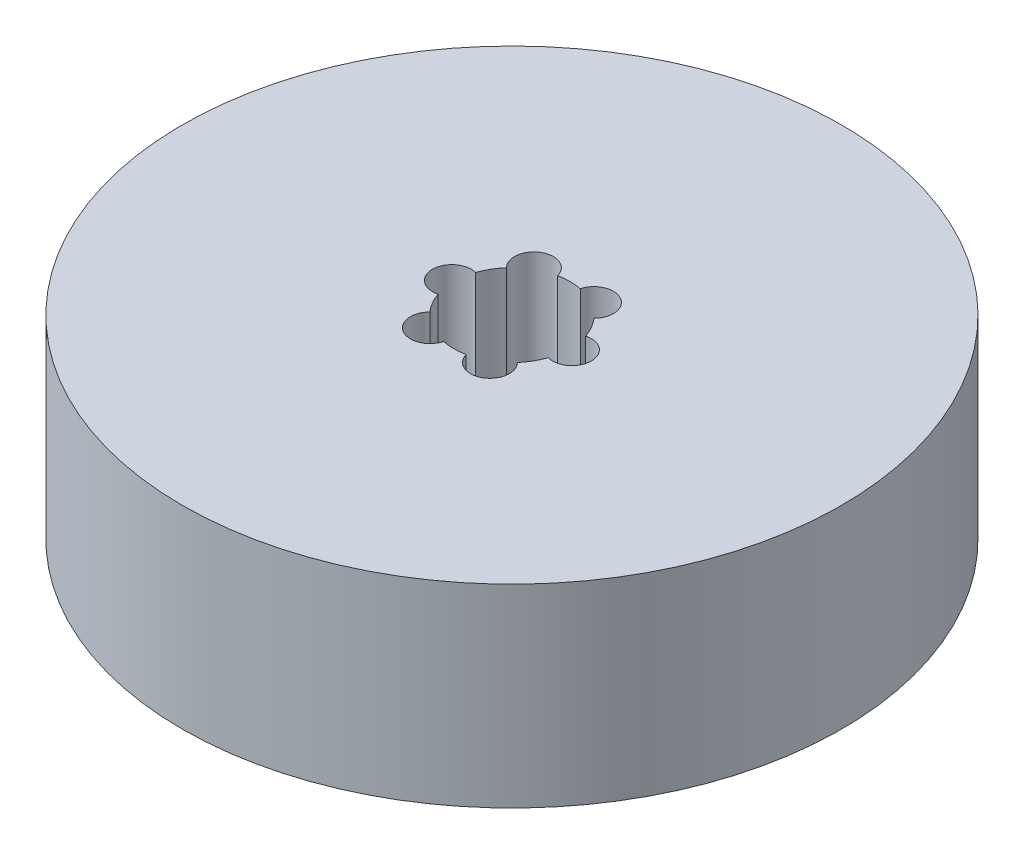
ISO-10303-21;
HEADER;
FILE_DESCRIPTION(('STEP AP214'),'2;1');
FILE_NAME('part.step','',(''),(''),'','','');
FILE_SCHEMA(('AUTOMOTIVE_DESIGN { 1 0 10303 214 1 1 1 1 }'));
ENDSEC;
DATA;
#1=APPLICATION_CONTEXT('core data for automotive mechanical design processes');
#2=APPLICATION_PROTOCOL_DEFINITION('international standard','automotive_design',2000,#1);
#3=PRODUCT_CONTEXT('',#1,'mechanical');
#4=PRODUCT('Part','Part','',(#3));
#5=PRODUCT_RELATED_PRODUCT_CATEGORY('part','',(#4));
#6=PRODUCT_DEFINITION_FORMATION('','',#4);
#7=PRODUCT_DEFINITION_CONTEXT('part definition',#1,'design');
#8=PRODUCT_DEFINITION('design','',#6,#7);
#9=PRODUCT_DEFINITION_SHAPE('','',#8);
#10=(LENGTH_UNIT() NAMED_UNIT(*) SI_UNIT(.MILLI.,.METRE.));
#11=(NAMED_UNIT(*) PLANE_ANGLE_UNIT() SI_UNIT($,.RADIAN.));
#12=(NAMED_UNIT(*) SI_UNIT($,.STERADIAN.) SOLID_ANGLE_UNIT());
#13=UNCERTAINTY_MEASURE_WITH_UNIT(LENGTH_MEASURE(1.E-05),#10,'distance_accuracy_value','');
#14=(GEOMETRIC_REPRESENTATION_CONTEXT(3) GLOBAL_UNCERTAINTY_ASSIGNED_CONTEXT((#13)) GLOBAL_UNIT_ASSIGNED_CONTEXT((#10,
#11,#12)) REPRESENTATION_CONTEXT('',''));
#15=CARTESIAN_POINT('',(0.,0.,0.));
#16=DIRECTION('',(0.,0.,1.));
#17=DIRECTION('',(1.,0.,0.));
#18=AXIS2_PLACEMENT_3D('',#15,#16,#17);
#19=CARTESIAN_POINT('',(0.,25.,0.));
#20=DIRECTION('',(0.,-1.,0.));
#21=DIRECTION('',(0.,0.,-1.));
#22=AXIS2_PLACEMENT_3D('',#19,#20,#21);
#23=CYLINDRICAL_SURFACE('',#22,42.5);
#24=CARTESIAN_POINT('',(0.,25.,0.));
#25=DIRECTION('',(0.,1.,0.));
#26=DIRECTION('',(0.,0.,1.));
#27=AXIS2_PLACEMENT_3D('',#24,#25,#26);
#28=CIRCLE('',#27,42.5);
#29=CARTESIAN_POINT('',(0.,25.,42.5));
#30=VERTEX_POINT('',#29);
#31=EDGE_CURVE('E171',#30,#30,#28,.T.);
#32=ORIENTED_EDGE('',*,*,#31,.F.);
#33=EDGE_LOOP('',(#32));
#34=FACE_BOUND('',#33,.T.);
#35=CARTESIAN_POINT('',(0.,0.,0.));
#36=DIRECTION('',(0.,1.,0.));
#37=DIRECTION('',(0.,0.,1.));
#38=AXIS2_PLACEMENT_3D('',#35,#36,#37);
#39=CIRCLE('',#38,42.5);
#40=CARTESIAN_POINT('',(0.,0.,42.5));
#41=VERTEX_POINT('',#40);
#42=EDGE_CURVE('E157',#41,#41,#39,.T.);
#43=ORIENTED_EDGE('',*,*,#42,.T.);
#44=EDGE_LOOP('',(#43));
#45=FACE_BOUND('',#44,.T.);
#46=ADVANCED_FACE('F39',(#34,#45),#23,.T.);
#47=CARTESIAN_POINT('',(0.,25.,0.));
#48=DIRECTION('',(0.,1.,0.));
#49=DIRECTION('',(0.,0.,1.));
#50=AXIS2_PLACEMENT_3D('',#47,#48,#49);
#51=PLANE('',#50);
#52=CARTESIAN_POINT('',(-3.87316655264964,25.,-6.70852125536539));
#53=DIRECTION('',(0.,1.,0.));
#54=DIRECTION('',(-0.866025403784433,0.,0.50000000000001));
#55=AXIS2_PLACEMENT_3D('',#52,#53,#54);
#56=CIRCLE('',#55,2.50070578781574);
#57=CARTESIAN_POINT('',(-1.45798384404562,25.,-7.35692076282611));
#58=VERTEX_POINT('',#57);
#59=CARTESIAN_POINT('',(-5.64228835221391,25.,-4.94111142866372));
#60=VERTEX_POINT('',#59);
#61=EDGE_CURVE('E214',#58,#60,#56,.T.);
#62=ORIENTED_EDGE('',*,*,#61,.F.);
#63=CARTESIAN_POINT('',(0.,25.,0.));
#64=DIRECTION('',(0.,1.,0.));
#65=DIRECTION('',(0.,0.,1.));
#66=AXIS2_PLACEMENT_3D('',#63,#64,#65);
#67=CIRCLE('',#66,7.5);
#68=CARTESIAN_POINT('',(1.45798384404547,25.,-7.35692076282614));
#69=VERTEX_POINT('',#68);
#70=EDGE_CURVE('E272',#69,#58,#67,.T.);
#71=ORIENTED_EDGE('',*,*,#70,.F.);
#72=CARTESIAN_POINT('',(3.8731665526495,25.,-6.70852125536547));
#73=DIRECTION('',(0.,1.,0.));
#74=DIRECTION('',(-0.866025403784443,0.,-0.499999999999992));
#75=AXIS2_PLACEMENT_3D('',#72,#73,#74);
#76=CIRCLE('',#75,2.50070578781574);
#77=CARTESIAN_POINT('',(5.64228835221381,25.,-4.94111142866384));
#78=VERTEX_POINT('',#77);
#79=EDGE_CURVE('E285',#78,#69,#76,.T.);
#80=ORIENTED_EDGE('',*,*,#79,.F.);
#81=CARTESIAN_POINT('',(7.10027219625939,25.,-2.41580933416234));
#82=VERTEX_POINT('',#81);
#83=EDGE_CURVE('E165',#82,#78,#67,.T.);
#84=ORIENTED_EDGE('',*,*,#83,.F.);
#85=CARTESIAN_POINT('',(7.74633310529912,25.,0.));
#86=DIRECTION('',(0.,1.,0.));
#87=DIRECTION('',(0.,0.,-1.));
#88=AXIS2_PLACEMENT_3D('',#85,#86,#87);
#89=CIRCLE('',#88,2.50070578781574);
#90=CARTESIAN_POINT('',(7.10027219625939,25.,2.41580933416234));
#91=VERTEX_POINT('',#90);
#92=EDGE_CURVE('E281',#91,#82,#89,.T.);
#93=ORIENTED_EDGE('',*,*,#92,.F.);
#94=CARTESIAN_POINT('',(5.64228835221387,25.,4.94111142866376));
#95=VERTEX_POINT('',#94);
#96=EDGE_CURVE('E160',#95,#91,#67,.T.);
#97=ORIENTED_EDGE('',*,*,#96,.F.);
#98=CARTESIAN_POINT('',(3.87316655264959,25.,6.70852125536542));
#99=DIRECTION('',(0.,1.,0.));
#100=DIRECTION('',(0.866025403784436,0.,-0.500000000000004));
#101=AXIS2_PLACEMENT_3D('',#98,#99,#100);
#102=CIRCLE('',#101,2.50070578781574);
#103=CARTESIAN_POINT('',(1.45798384404557,25.,7.35692076282612));
#104=VERTEX_POINT('',#103);
#105=EDGE_CURVE('E154',#104,#95,#102,.T.);
#106=ORIENTED_EDGE('',*,*,#105,.F.);
#107=CARTESIAN_POINT('',(-1.45798384404552,25.,7.35692076282613));
#108=VERTEX_POINT('',#107);
#109=EDGE_CURVE('E150',#108,#104,#67,.T.);
#110=ORIENTED_EDGE('',*,*,#109,.F.);
#111=CARTESIAN_POINT('',(-3.87316655264955,25.,6.70852125536545));
#112=DIRECTION('',(0.,1.,0.));
#113=DIRECTION('',(0.86602540378444,0.,0.499999999999998));
#114=AXIS2_PLACEMENT_3D('',#111,#112,#113);
#115=CIRCLE('',#114,2.50070578781574);
#116=CARTESIAN_POINT('',(-5.64228835221384,25.,4.9411114286638));
#117=VERTEX_POINT('',#116);
#118=EDGE_CURVE('E127',#117,#108,#115,.T.);
#119=ORIENTED_EDGE('',*,*,#118,.F.);
#120=CARTESIAN_POINT('',(-7.10027219625939,25.,2.41580933416234));
#121=VERTEX_POINT('',#120);
#122=EDGE_CURVE('E156',#121,#117,#67,.T.);
#123=ORIENTED_EDGE('',*,*,#122,.F.);
#124=CARTESIAN_POINT('',(-7.74633310529912,25.,0.));
#125=DIRECTION('',(0.,1.,0.));
#126=DIRECTION('',(0.,0.,1.));
#127=AXIS2_PLACEMENT_3D('',#124,#125,#126);
#128=CIRCLE('',#127,2.50070578781574);
#129=CARTESIAN_POINT('',(-7.10027219625939,25.,-2.41580933416234));
#130=VERTEX_POINT('',#129);
#131=EDGE_CURVE('E164',#130,#121,#128,.T.);
#132=ORIENTED_EDGE('',*,*,#131,.F.);
#133=EDGE_CURVE('E159',#60,#130,#67,.T.);
#134=ORIENTED_EDGE('',*,*,#133,.F.);
#135=EDGE_LOOP('',(#62,#71,#80,#84,#93,#97,#106,#110,#119,#123,#132,#134));
#136=FACE_BOUND('',#135,.T.);
#137=ORIENTED_EDGE('',*,*,#31,.T.);
#138=EDGE_LOOP('',(#137));
#139=FACE_BOUND('',#138,.T.);
#140=ADVANCED_FACE('F155',(#136,#139),#51,.T.);
#141=CARTESIAN_POINT('',(0.,0.,0.));
#142=DIRECTION('',(0.,1.,0.));
#143=DIRECTION('',(0.,0.,1.));
#144=AXIS2_PLACEMENT_3D('',#141,#142,#143);
#145=PLANE('',#144);
#146=CARTESIAN_POINT('',(0.,0.,0.));
#147=DIRECTION('',(0.,1.,0.));
#148=DIRECTION('',(0.,0.,1.));
#149=AXIS2_PLACEMENT_3D('',#146,#147,#148);
#150=CIRCLE('',#149,7.5);
#151=CARTESIAN_POINT('',(0.,0.,7.5));
#152=VERTEX_POINT('',#151);
#153=EDGE_CURVE('E170',#152,#152,#150,.T.);
#154=ORIENTED_EDGE('',*,*,#153,.T.);
#155=EDGE_LOOP('',(#154));
#156=FACE_BOUND('',#155,.T.);
#157=ORIENTED_EDGE('',*,*,#42,.F.);
#158=EDGE_LOOP('',(#157));
#159=FACE_BOUND('',#158,.T.);
#160=ADVANCED_FACE('F232',(#156,#159),#145,.F.);
#161=CARTESIAN_POINT('',(0.,25.,0.));
#162=DIRECTION('',(0.,-1.,0.));
#163=DIRECTION('',(0.,0.,-1.));
#164=AXIS2_PLACEMENT_3D('',#161,#162,#163);
#165=CYLINDRICAL_SURFACE('',#164,7.5);
#166=DIRECTION('',(0.,1.,0.));
#167=VECTOR('',#166,1.);
#168=CARTESIAN_POINT('',(-1.45798384404562,16.9126249795418,-7.35692076282611));
#169=LINE('',#168,#167);
#170=CARTESIAN_POINT('',(-1.45798384404562,8.82524995908369,-7.35692076282611));
#171=VERTEX_POINT('',#170);
#172=EDGE_CURVE('E11',#171,#58,#169,.T.);
#173=ORIENTED_EDGE('',*,*,#172,.F.);
#174=CARTESIAN_POINT('',(0.,8.82524995908369,0.));
#175=DIRECTION('',(0.,1.,0.));
#176=DIRECTION('',(0.,0.,1.));
#177=AXIS2_PLACEMENT_3D('',#174,#175,#176);
#178=CIRCLE('',#177,7.5);
#179=CARTESIAN_POINT('',(-5.64228835221391,8.82524995908369,-4.94111142866372));
#180=VERTEX_POINT('',#179);
#181=EDGE_CURVE('E209',#171,#180,#178,.T.);
#182=ORIENTED_EDGE('',*,*,#181,.T.);
#183=DIRECTION('',(0.,1.,0.));
#184=VECTOR('',#183,1.);
#185=CARTESIAN_POINT('',(-5.64228835221391,16.9126249795418,-4.94111142866372));
#186=LINE('',#185,#184);
#187=EDGE_CURVE('E46',#60,#180,#186,.F.);
#188=ORIENTED_EDGE('',*,*,#187,.F.);
#189=ORIENTED_EDGE('',*,*,#133,.T.);
#190=DIRECTION('',(0.,1.,0.));
#191=VECTOR('',#190,1.);
#192=CARTESIAN_POINT('',(-7.10027219625939,16.9126249795418,-2.41580933416234));
#193=LINE('',#192,#191);
#194=CARTESIAN_POINT('',(-7.10027219625939,8.82524995908369,-2.41580933416234));
#195=VERTEX_POINT('',#194);
#196=EDGE_CURVE('E185',#195,#130,#193,.T.);
#197=ORIENTED_EDGE('',*,*,#196,.F.);
#198=CARTESIAN_POINT('',(0.,8.82524995908369,0.));
#199=DIRECTION('',(0.,1.,0.));
#200=DIRECTION('',(0.,0.,1.));
#201=AXIS2_PLACEMENT_3D('',#198,#199,#200);
#202=CIRCLE('',#201,7.5);
#203=CARTESIAN_POINT('',(-7.10027219625939,8.82524995908369,2.41580933416234));
#204=VERTEX_POINT('',#203);
#205=EDGE_CURVE('E173',#195,#204,#202,.T.);
#206=ORIENTED_EDGE('',*,*,#205,.T.);
#207=DIRECTION('',(0.,1.,0.));
#208=VECTOR('',#207,1.);
#209=CARTESIAN_POINT('',(-7.10027219625939,16.9126249795418,2.41580933416234));
#210=LINE('',#209,#208);
#211=EDGE_CURVE('E178',#121,#204,#210,.F.);
#212=ORIENTED_EDGE('',*,*,#211,.F.);
#213=ORIENTED_EDGE('',*,*,#122,.T.);
#214=DIRECTION('',(0.,1.,0.));
#215=VECTOR('',#214,1.);
#216=CARTESIAN_POINT('',(-5.64228835221384,16.9126249795418,4.9411114286638));
#217=LINE('',#216,#215);
#218=CARTESIAN_POINT('',(-5.64228835221384,8.82524995908369,4.9411114286638));
#219=VERTEX_POINT('',#218);
#220=EDGE_CURVE('E132',#219,#117,#217,.T.);
#221=ORIENTED_EDGE('',*,*,#220,.F.);
#222=CARTESIAN_POINT('',(0.,8.82524995908369,0.));
#223=DIRECTION('',(0.,1.,0.));
#224=DIRECTION('',(0.,0.,1.));
#225=AXIS2_PLACEMENT_3D('',#222,#223,#224);
#226=CIRCLE('',#225,7.5);
#227=CARTESIAN_POINT('',(-1.45798384404552,8.82524995908369,7.35692076282613));
#228=VERTEX_POINT('',#227);
#229=EDGE_CURVE('E146',#219,#228,#226,.T.);
#230=ORIENTED_EDGE('',*,*,#229,.T.);
#231=DIRECTION('',(0.,1.,0.));
#232=VECTOR('',#231,1.);
#233=CARTESIAN_POINT('',(-1.45798384404552,16.9126249795418,7.35692076282613));
#234=LINE('',#233,#232);
#235=EDGE_CURVE('E128',#108,#228,#234,.F.);
#236=ORIENTED_EDGE('',*,*,#235,.F.);
#237=ORIENTED_EDGE('',*,*,#109,.T.);
#238=DIRECTION('',(0.,1.,0.));
#239=VECTOR('',#238,1.);
#240=CARTESIAN_POINT('',(1.45798384404557,16.9126249795418,7.35692076282612));
#241=LINE('',#240,#239);
#242=CARTESIAN_POINT('',(1.45798384404557,8.82524995908369,7.35692076282612));
#243=VERTEX_POINT('',#242);
#244=EDGE_CURVE('E192',#243,#104,#241,.T.);
#245=ORIENTED_EDGE('',*,*,#244,.F.);
#246=CARTESIAN_POINT('',(0.,8.82524995908369,0.));
#247=DIRECTION('',(0.,1.,0.));
#248=DIRECTION('',(0.,0.,1.));
#249=AXIS2_PLACEMENT_3D('',#246,#247,#248);
#250=CIRCLE('',#249,7.5);
#251=CARTESIAN_POINT('',(5.64228835221387,8.82524995908369,4.94111142866376));
#252=VERTEX_POINT('',#251);
#253=EDGE_CURVE('E190',#243,#252,#250,.T.);
#254=ORIENTED_EDGE('',*,*,#253,.T.);
#255=DIRECTION('',(0.,1.,0.));
#256=VECTOR('',#255,1.);
#257=CARTESIAN_POINT('',(5.64228835221387,16.9126249795418,4.94111142866376));
#258=LINE('',#257,#256);
#259=EDGE_CURVE('E189',#95,#252,#258,.F.);
#260=ORIENTED_EDGE('',*,*,#259,.F.);
#261=ORIENTED_EDGE('',*,*,#96,.T.);
#262=DIRECTION('',(0.,1.,0.));
#263=VECTOR('',#262,1.);
#264=CARTESIAN_POINT('',(7.10027219625939,16.9126249795418,2.41580933416234));
#265=LINE('',#264,#263);
#266=CARTESIAN_POINT('',(7.10027219625939,8.82524995908369,2.41580933416234));
#267=VERTEX_POINT('',#266);
#268=EDGE_CURVE('E203',#267,#91,#265,.T.);
#269=ORIENTED_EDGE('',*,*,#268,.F.);
#270=CARTESIAN_POINT('',(0.,8.82524995908369,0.));
#271=DIRECTION('',(0.,1.,0.));
#272=DIRECTION('',(0.,0.,1.));
#273=AXIS2_PLACEMENT_3D('',#270,#271,#272);
#274=CIRCLE('',#273,7.5);
#275=CARTESIAN_POINT('',(7.10027219625939,8.82524995908369,-2.41580933416234));
#276=VERTEX_POINT('',#275);
#277=EDGE_CURVE('E194',#267,#276,#274,.T.);
#278=ORIENTED_EDGE('',*,*,#277,.T.);
#279=DIRECTION('',(0.,1.,0.));
#280=VECTOR('',#279,1.);
#281=CARTESIAN_POINT('',(7.10027219625939,16.9126249795418,-2.41580933416234));
#282=LINE('',#281,#280);
#283=EDGE_CURVE('E196',#82,#276,#282,.F.);
#284=ORIENTED_EDGE('',*,*,#283,.F.);
#285=ORIENTED_EDGE('',*,*,#83,.T.);
#286=DIRECTION('',(0.,1.,0.));
#287=VECTOR('',#286,1.);
#288=CARTESIAN_POINT('',(5.64228835221381,16.9126249795418,-4.94111142866384));
#289=LINE('',#288,#287);
#290=CARTESIAN_POINT('',(5.64228835221381,8.82524995908369,-4.94111142866384));
#291=VERTEX_POINT('',#290);
#292=EDGE_CURVE('E208',#291,#78,#289,.T.);
#293=ORIENTED_EDGE('',*,*,#292,.F.);
#294=CARTESIAN_POINT('',(0.,8.82524995908369,0.));
#295=DIRECTION('',(0.,1.,0.));
#296=DIRECTION('',(0.,0.,1.));
#297=AXIS2_PLACEMENT_3D('',#294,#295,#296);
#298=CIRCLE('',#297,7.5);
#299=CARTESIAN_POINT('',(1.45798384404547,8.82524995908369,-7.35692076282614));
#300=VERTEX_POINT('',#299);
#301=EDGE_CURVE('E201',#291,#300,#298,.T.);
#302=ORIENTED_EDGE('',*,*,#301,.T.);
#303=DIRECTION('',(0.,1.,0.));
#304=VECTOR('',#303,1.);
#305=CARTESIAN_POINT('',(1.45798384404547,16.9126249795418,-7.35692076282614));
#306=LINE('',#305,#304);
#307=EDGE_CURVE('E206',#69,#300,#306,.F.);
#308=ORIENTED_EDGE('',*,*,#307,.F.);
#309=ORIENTED_EDGE('',*,*,#70,.T.);
#310=EDGE_LOOP('',(#173,#182,#188,#189,#197,#206,#212,#213,#221,#230,#236,#237,#245,#254,#260,
#261,#269,#278,#284,#285,#293,#302,#308,#309));
#311=FACE_BOUND('',#310,.T.);
#312=ORIENTED_EDGE('',*,*,#153,.F.);
#313=EDGE_LOOP('',(#312));
#314=FACE_BOUND('',#313,.T.);
#315=ADVANCED_FACE('F145',(#311,#314),#165,.F.);
#316=CARTESIAN_POINT('',(-7.74633310529912,8.82524995908369,0.));
#317=DIRECTION('',(0.,1.,0.));
#318=DIRECTION('',(0.,0.,1.));
#319=AXIS2_PLACEMENT_3D('',#316,#317,#318);
#320=CYLINDRICAL_SURFACE('',#319,2.50070578781574);
#321=ORIENTED_EDGE('',*,*,#196,.T.);
#322=ORIENTED_EDGE('',*,*,#131,.T.);
#323=ORIENTED_EDGE('',*,*,#211,.T.);
#324=CARTESIAN_POINT('',(-7.74633310529912,8.82524995908369,0.));
#325=DIRECTION('',(0.,1.,0.));
#326=DIRECTION('',(0.,0.,1.));
#327=AXIS2_PLACEMENT_3D('',#324,#325,#326);
#328=CIRCLE('',#327,2.50070578781574);
#329=EDGE_CURVE('E168',#195,#204,#328,.T.);
#330=ORIENTED_EDGE('',*,*,#329,.F.);
#331=EDGE_LOOP('',(#321,#322,#323,#330));
#332=FACE_BOUND('',#331,.T.);
#333=ADVANCED_FACE('F243',(#332),#320,.F.);
#334=CARTESIAN_POINT('',(-7.74633310529912,8.82524995908369,0.));
#335=DIRECTION('',(0.,1.,0.));
#336=DIRECTION('',(0.,0.,1.));
#337=AXIS2_PLACEMENT_3D('',#334,#335,#336);
#338=PLANE('',#337);
#339=ORIENTED_EDGE('',*,*,#329,.T.);
#340=ORIENTED_EDGE('',*,*,#205,.F.);
#341=EDGE_LOOP('',(#339,#340));
#342=FACE_BOUND('',#341,.T.);
#343=ADVANCED_FACE('F247',(#342),#338,.T.);
#344=CARTESIAN_POINT('',(-3.87316655264955,8.82524995908369,6.70852125536545));
#345=DIRECTION('',(0.,1.,0.));
#346=DIRECTION('',(0.,0.,1.));
#347=AXIS2_PLACEMENT_3D('',#344,#345,#346);
#348=CYLINDRICAL_SURFACE('',#347,2.50070578781574);
#349=ORIENTED_EDGE('',*,*,#220,.T.);
#350=ORIENTED_EDGE('',*,*,#118,.T.);
#351=ORIENTED_EDGE('',*,*,#235,.T.);
#352=CARTESIAN_POINT('',(-3.87316655264955,8.82524995908369,6.70852125536545));
#353=DIRECTION('',(0.,1.,0.));
#354=DIRECTION('',(0.86602540378444,0.,0.499999999999998));
#355=AXIS2_PLACEMENT_3D('',#352,#353,#354);
#356=CIRCLE('',#355,2.50070578781574);
#357=EDGE_CURVE('E137',#219,#228,#356,.T.);
#358=ORIENTED_EDGE('',*,*,#357,.F.);
#359=EDGE_LOOP('',(#349,#350,#351,#358));
#360=FACE_BOUND('',#359,.T.);
#361=ADVANCED_FACE('F126',(#360),#348,.F.);
#362=CARTESIAN_POINT('',(-3.87316655264955,8.82524995908369,6.70852125536545));
#363=DIRECTION('',(0.,1.,0.));
#364=DIRECTION('',(0.86602540378444,0.,0.499999999999998));
#365=AXIS2_PLACEMENT_3D('',#362,#363,#364);
#366=PLANE('',#365);
#367=ORIENTED_EDGE('',*,*,#357,.T.);
#368=ORIENTED_EDGE('',*,*,#229,.F.);
#369=EDGE_LOOP('',(#367,#368));
#370=FACE_BOUND('',#369,.T.);
#371=ADVANCED_FACE('F254',(#370),#366,.T.);
#372=CARTESIAN_POINT('',(3.87316655264959,8.82524995908369,6.70852125536542));
#373=DIRECTION('',(0.,1.,0.));
#374=DIRECTION('',(0.,0.,1.));
#375=AXIS2_PLACEMENT_3D('',#372,#373,#374);
#376=CYLINDRICAL_SURFACE('',#375,2.50070578781574);
#377=ORIENTED_EDGE('',*,*,#244,.T.);
#378=ORIENTED_EDGE('',*,*,#105,.T.);
#379=ORIENTED_EDGE('',*,*,#259,.T.);
#380=CARTESIAN_POINT('',(3.87316655264959,8.82524995908369,6.70852125536542));
#381=DIRECTION('',(0.,1.,0.));
#382=DIRECTION('',(0.866025403784436,0.,-0.500000000000004));
#383=AXIS2_PLACEMENT_3D('',#380,#381,#382);
#384=CIRCLE('',#383,2.50070578781574);
#385=EDGE_CURVE('E138',#243,#252,#384,.T.);
#386=ORIENTED_EDGE('',*,*,#385,.F.);
#387=EDGE_LOOP('',(#377,#378,#379,#386));
#388=FACE_BOUND('',#387,.T.);
#389=ADVANCED_FACE('F260',(#388),#376,.F.);
#390=CARTESIAN_POINT('',(3.87316655264959,8.82524995908369,6.70852125536542));
#391=DIRECTION('',(0.,1.,0.));
#392=DIRECTION('',(0.866025403784436,0.,-0.500000000000004));
#393=AXIS2_PLACEMENT_3D('',#390,#391,#392);
#394=PLANE('',#393);
#395=ORIENTED_EDGE('',*,*,#385,.T.);
#396=ORIENTED_EDGE('',*,*,#253,.F.);
#397=EDGE_LOOP('',(#395,#396));
#398=FACE_BOUND('',#397,.T.);
#399=ADVANCED_FACE('F265',(#398),#394,.T.);
#400=CARTESIAN_POINT('',(7.74633310529912,8.82524995908369,0.));
#401=DIRECTION('',(0.,1.,0.));
#402=DIRECTION('',(0.,0.,1.));
#403=AXIS2_PLACEMENT_3D('',#400,#401,#402);
#404=CYLINDRICAL_SURFACE('',#403,2.50070578781574);
#405=ORIENTED_EDGE('',*,*,#268,.T.);
#406=ORIENTED_EDGE('',*,*,#92,.T.);
#407=ORIENTED_EDGE('',*,*,#283,.T.);
#408=CARTESIAN_POINT('',(7.74633310529912,8.82524995908369,0.));
#409=DIRECTION('',(0.,1.,0.));
#410=DIRECTION('',(0.,0.,-1.));
#411=AXIS2_PLACEMENT_3D('',#408,#409,#410);
#412=CIRCLE('',#411,2.50070578781574);
#413=EDGE_CURVE('E287',#267,#276,#412,.T.);
#414=ORIENTED_EDGE('',*,*,#413,.F.);
#415=EDGE_LOOP('',(#405,#406,#407,#414));
#416=FACE_BOUND('',#415,.T.);
#417=ADVANCED_FACE('F300',(#416),#404,.F.);
#418=CARTESIAN_POINT('',(7.74633310529912,8.82524995908369,0.));
#419=DIRECTION('',(0.,1.,0.));
#420=DIRECTION('',(0.,0.,-1.));
#421=AXIS2_PLACEMENT_3D('',#418,#419,#420);
#422=PLANE('',#421);
#423=ORIENTED_EDGE('',*,*,#413,.T.);
#424=ORIENTED_EDGE('',*,*,#277,.F.);
#425=EDGE_LOOP('',(#423,#424));
#426=FACE_BOUND('',#425,.T.);
#427=ADVANCED_FACE('F298',(#426),#422,.T.);
#428=CARTESIAN_POINT('',(3.8731665526495,8.82524995908369,-6.70852125536547));
#429=DIRECTION('',(0.,1.,0.));
#430=DIRECTION('',(0.,0.,1.));
#431=AXIS2_PLACEMENT_3D('',#428,#429,#430);
#432=CYLINDRICAL_SURFACE('',#431,2.50070578781574);
#433=ORIENTED_EDGE('',*,*,#292,.T.);
#434=ORIENTED_EDGE('',*,*,#79,.T.);
#435=ORIENTED_EDGE('',*,*,#307,.T.);
#436=CARTESIAN_POINT('',(3.8731665526495,8.82524995908369,-6.70852125536547));
#437=DIRECTION('',(0.,1.,0.));
#438=DIRECTION('',(-0.866025403784443,0.,-0.499999999999992));
#439=AXIS2_PLACEMENT_3D('',#436,#437,#438);
#440=CIRCLE('',#439,2.50070578781574);
#441=EDGE_CURVE('E56',#291,#300,#440,.T.);
#442=ORIENTED_EDGE('',*,*,#441,.F.);
#443=EDGE_LOOP('',(#433,#434,#435,#442));
#444=FACE_BOUND('',#443,.T.);
#445=ADVANCED_FACE('F301',(#444),#432,.F.);
#446=CARTESIAN_POINT('',(3.8731665526495,8.82524995908369,-6.70852125536547));
#447=DIRECTION('',(0.,1.,0.));
#448=DIRECTION('',(-0.866025403784443,0.,-0.499999999999992));
#449=AXIS2_PLACEMENT_3D('',#446,#447,#448);
#450=PLANE('',#449);
#451=ORIENTED_EDGE('',*,*,#441,.T.);
#452=ORIENTED_EDGE('',*,*,#301,.F.);
#453=EDGE_LOOP('',(#451,#452));
#454=FACE_BOUND('',#453,.T.);
#455=ADVANCED_FACE('F221',(#454),#450,.T.);
#456=CARTESIAN_POINT('',(-3.87316655264964,8.82524995908369,-6.70852125536539));
#457=DIRECTION('',(0.,1.,0.));
#458=DIRECTION('',(0.,0.,1.));
#459=AXIS2_PLACEMENT_3D('',#456,#457,#458);
#460=CYLINDRICAL_SURFACE('',#459,2.50070578781574);
#461=ORIENTED_EDGE('',*,*,#172,.T.);
#462=ORIENTED_EDGE('',*,*,#61,.T.);
#463=ORIENTED_EDGE('',*,*,#187,.T.);
#464=CARTESIAN_POINT('',(-3.87316655264964,8.82524995908369,-6.70852125536539));
#465=DIRECTION('',(0.,1.,0.));
#466=DIRECTION('',(-0.866025403784433,0.,0.50000000000001));
#467=AXIS2_PLACEMENT_3D('',#464,#465,#466);
#468=CIRCLE('',#467,2.50070578781574);
#469=EDGE_CURVE('E55',#171,#180,#468,.T.);
#470=ORIENTED_EDGE('',*,*,#469,.F.);
#471=EDGE_LOOP('',(#461,#462,#463,#470));
#472=FACE_BOUND('',#471,.T.);
#473=ADVANCED_FACE('F212',(#472),#460,.F.);
#474=CARTESIAN_POINT('',(-3.87316655264964,8.82524995908369,-6.70852125536539));
#475=DIRECTION('',(0.,1.,0.));
#476=DIRECTION('',(-0.866025403784433,0.,0.50000000000001));
#477=AXIS2_PLACEMENT_3D('',#474,#475,#476);
#478=PLANE('',#477);
#479=ORIENTED_EDGE('',*,*,#469,.T.);
#480=ORIENTED_EDGE('',*,*,#181,.F.);
#481=EDGE_LOOP('',(#479,#480));
#482=FACE_BOUND('',#481,.T.);
#483=ADVANCED_FACE('F217',(#482),#478,.T.);
#484=CLOSED_SHELL('',(#46,#140,#160,#315,#333,#343,#361,#371,#389,#399,#417,#427,#445,#455,#473,#483));
#485=MANIFOLD_SOLID_BREP('B2',#484);
#486=ADVANCED_BREP_SHAPE_REPRESENTATION('',(#18,#485),#14);
#487=SHAPE_DEFINITION_REPRESENTATION(#9,#486);
ENDSEC;
END-ISO-10303-21;
